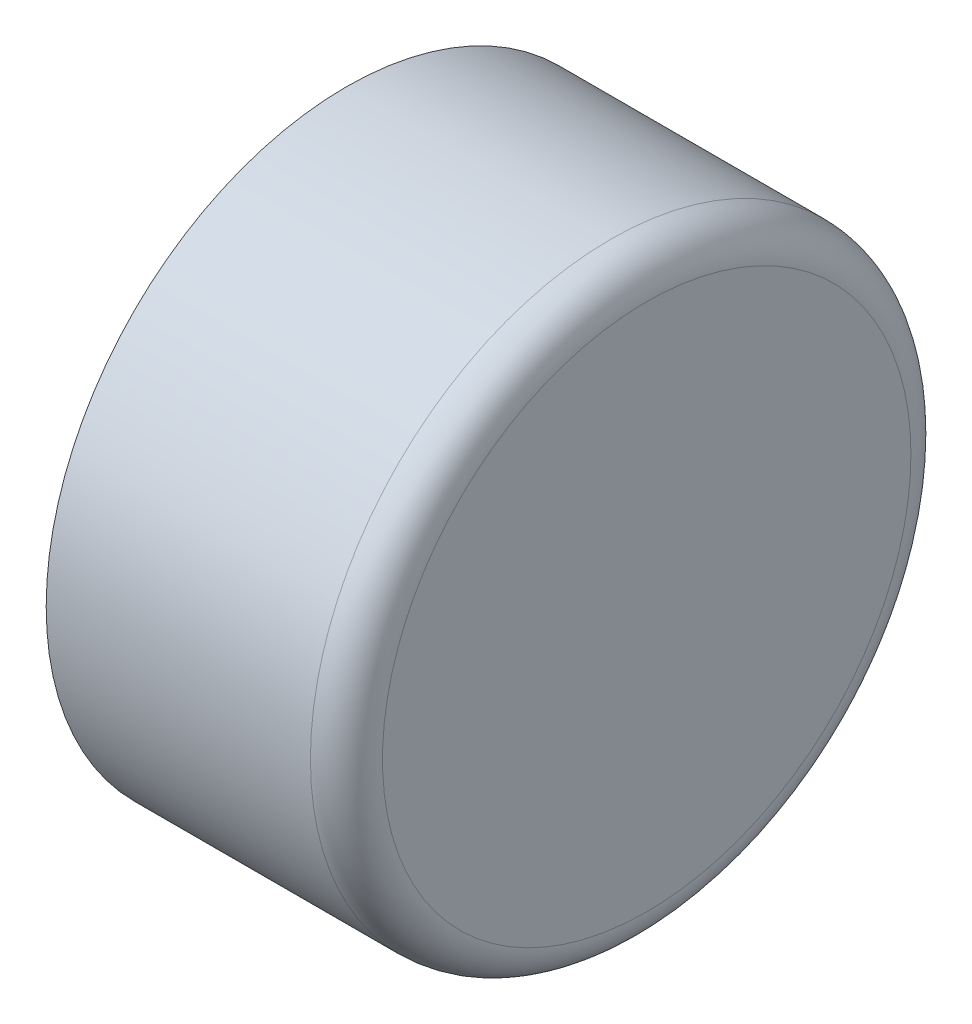
ISO-10303-21;
HEADER;
FILE_DESCRIPTION(('STEP AP214'),'2;1');
FILE_NAME('part.step','',(''),(''),'','','');
FILE_SCHEMA(('AUTOMOTIVE_DESIGN { 1 0 10303 214 1 1 1 1 }'));
ENDSEC;
DATA;
#1=APPLICATION_CONTEXT('core data for automotive mechanical design processes');
#2=APPLICATION_PROTOCOL_DEFINITION('international standard','automotive_design',2000,#1);
#3=PRODUCT_CONTEXT('',#1,'mechanical');
#4=PRODUCT('Part','Part','',(#3));
#5=PRODUCT_RELATED_PRODUCT_CATEGORY('part','',(#4));
#6=PRODUCT_DEFINITION_FORMATION('','',#4);
#7=PRODUCT_DEFINITION_CONTEXT('part definition',#1,'design');
#8=PRODUCT_DEFINITION('design','',#6,#7);
#9=PRODUCT_DEFINITION_SHAPE('','',#8);
#10=(LENGTH_UNIT() NAMED_UNIT(*) SI_UNIT(.MILLI.,.METRE.));
#11=(NAMED_UNIT(*) PLANE_ANGLE_UNIT() SI_UNIT($,.RADIAN.));
#12=(NAMED_UNIT(*) SI_UNIT($,.STERADIAN.) SOLID_ANGLE_UNIT());
#13=UNCERTAINTY_MEASURE_WITH_UNIT(LENGTH_MEASURE(1.E-05),#10,'distance_accuracy_value','');
#14=(GEOMETRIC_REPRESENTATION_CONTEXT(3) GLOBAL_UNCERTAINTY_ASSIGNED_CONTEXT((#13)) GLOBAL_UNIT_ASSIGNED_CONTEXT((#10,
#11,#12)) REPRESENTATION_CONTEXT('',''));
#15=CARTESIAN_POINT('',(0.,0.,0.));
#16=DIRECTION('',(0.,0.,1.));
#17=DIRECTION('',(1.,0.,0.));
#18=AXIS2_PLACEMENT_3D('',#15,#16,#17);
#19=CARTESIAN_POINT('',(3.175,0.,-11.176));
#20=DIRECTION('',(1.,0.,0.));
#21=DIRECTION('',(0.,0.,-1.));
#22=AXIS2_PLACEMENT_3D('',#19,#20,#21);
#23=PLANE('',#22);
#24=CARTESIAN_POINT('',(3.175,0.,0.));
#25=DIRECTION('',(1.,0.,0.));
#26=DIRECTION('',(0.,0.,-1.));
#27=AXIS2_PLACEMENT_3D('',#24,#25,#26);
#28=CIRCLE('',#27,11.176);
#29=CARTESIAN_POINT('',(3.175,0.,-11.176));
#30=VERTEX_POINT('',#29);
#31=EDGE_CURVE('E10',#30,#30,#28,.T.);
#32=ORIENTED_EDGE('',*,*,#31,.T.);
#33=EDGE_LOOP('',(#32));
#34=FACE_BOUND('',#33,.T.);
#35=ADVANCED_FACE('F43',(#34),#23,.T.);
#36=CARTESIAN_POINT('',(1.651,0.,0.));
#37=DIRECTION('',(1.,0.,0.));
#38=DIRECTION('',(0.,0.,-1.));
#39=AXIS2_PLACEMENT_3D('',#36,#37,#38);
#40=TOROIDAL_SURFACE('',#39,11.176,1.524);
#41=CARTESIAN_POINT('',(1.65099999999999,0.,0.));
#42=DIRECTION('',(1.,0.,0.));
#43=DIRECTION('',(0.,0.,-1.));
#44=AXIS2_PLACEMENT_3D('',#41,#42,#43);
#45=CIRCLE('',#44,12.7);
#46=CARTESIAN_POINT('',(1.65099999999999,0.,-12.7));
#47=VERTEX_POINT('',#46);
#48=EDGE_CURVE('E50',#47,#47,#45,.T.);
#49=ORIENTED_EDGE('',*,*,#48,.T.);
#50=EDGE_LOOP('',(#49));
#51=FACE_BOUND('',#50,.T.);
#52=ORIENTED_EDGE('',*,*,#31,.F.);
#53=EDGE_LOOP('',(#52));
#54=FACE_BOUND('',#53,.T.);
#55=ADVANCED_FACE('F95',(#51,#54),#40,.T.);
#56=CARTESIAN_POINT('',(3.175,0.,0.));
#57=DIRECTION('',(1.,0.,0.));
#58=DIRECTION('',(0.,0.,-1.));
#59=AXIS2_PLACEMENT_3D('',#56,#57,#58);
#60=CYLINDRICAL_SURFACE('',#59,12.7);
#61=CARTESIAN_POINT('',(-9.525,0.,0.));
#62=DIRECTION('',(1.,0.,0.));
#63=DIRECTION('',(0.,0.,-1.));
#64=AXIS2_PLACEMENT_3D('',#61,#62,#63);
#65=CIRCLE('',#64,12.7);
#66=CARTESIAN_POINT('',(-9.525,0.,-12.7));
#67=VERTEX_POINT('',#66);
#68=EDGE_CURVE('E55',#67,#67,#65,.T.);
#69=ORIENTED_EDGE('',*,*,#68,.T.);
#70=EDGE_LOOP('',(#69));
#71=FACE_BOUND('',#70,.T.);
#72=ORIENTED_EDGE('',*,*,#48,.F.);
#73=EDGE_LOOP('',(#72));
#74=FACE_BOUND('',#73,.T.);
#75=ADVANCED_FACE('F99',(#71,#74),#60,.T.);
#76=CARTESIAN_POINT('',(-9.525,0.,-11.1125));
#77=DIRECTION('',(-1.,0.,0.));
#78=DIRECTION('',(0.,0.,1.));
#79=AXIS2_PLACEMENT_3D('',#76,#77,#78);
#80=PLANE('',#79);
#81=CARTESIAN_POINT('',(-9.525,0.,0.));
#82=DIRECTION('',(1.,0.,0.));
#83=DIRECTION('',(0.,0.,-1.));
#84=AXIS2_PLACEMENT_3D('',#81,#82,#83);
#85=CIRCLE('',#84,11.1125);
#86=CARTESIAN_POINT('',(-9.525,0.,-11.1125));
#87=VERTEX_POINT('',#86);
#88=EDGE_CURVE('E60',#87,#87,#85,.T.);
#89=ORIENTED_EDGE('',*,*,#88,.T.);
#90=EDGE_LOOP('',(#89));
#91=FACE_BOUND('',#90,.T.);
#92=ORIENTED_EDGE('',*,*,#68,.F.);
#93=EDGE_LOOP('',(#92));
#94=FACE_BOUND('',#93,.T.);
#95=ADVANCED_FACE('F103',(#91,#94),#80,.T.);
#96=CARTESIAN_POINT('',(3.175,0.,0.));
#97=DIRECTION('',(1.,0.,0.));
#98=DIRECTION('',(0.,0.,-1.));
#99=AXIS2_PLACEMENT_3D('',#96,#97,#98);
#100=CYLINDRICAL_SURFACE('',#99,11.1125);
#101=CARTESIAN_POINT('',(-7.9248,0.,0.));
#102=DIRECTION('',(1.,0.,0.));
#103=DIRECTION('',(0.,0.,-1.));
#104=AXIS2_PLACEMENT_3D('',#101,#102,#103);
#105=CIRCLE('',#104,11.1125);
#106=CARTESIAN_POINT('',(-7.9248,0.,-11.1125));
#107=VERTEX_POINT('',#106);
#108=EDGE_CURVE('E66',#107,#107,#105,.T.);
#109=ORIENTED_EDGE('',*,*,#108,.T.);
#110=EDGE_LOOP('',(#109));
#111=FACE_BOUND('',#110,.T.);
#112=ORIENTED_EDGE('',*,*,#88,.F.);
#113=EDGE_LOOP('',(#112));
#114=FACE_BOUND('',#113,.T.);
#115=ADVANCED_FACE('F110',(#111,#114),#100,.F.);
#116=CARTESIAN_POINT('',(-7.9248,0.,-9.525));
#117=DIRECTION('',(-1.,0.,0.));
#118=DIRECTION('',(0.,0.,1.));
#119=AXIS2_PLACEMENT_3D('',#116,#117,#118);
#120=PLANE('',#119);
#121=CARTESIAN_POINT('',(-7.9248,0.,0.));
#122=DIRECTION('',(1.,0.,0.));
#123=DIRECTION('',(0.,0.,-1.));
#124=AXIS2_PLACEMENT_3D('',#121,#122,#123);
#125=CIRCLE('',#124,9.525);
#126=CARTESIAN_POINT('',(-7.9248,0.,-9.525));
#127=VERTEX_POINT('',#126);
#128=EDGE_CURVE('E70',#127,#127,#125,.T.);
#129=ORIENTED_EDGE('',*,*,#128,.T.);
#130=EDGE_LOOP('',(#129));
#131=FACE_BOUND('',#130,.T.);
#132=ORIENTED_EDGE('',*,*,#108,.F.);
#133=EDGE_LOOP('',(#132));
#134=FACE_BOUND('',#133,.T.);
#135=ADVANCED_FACE('F114',(#131,#134),#120,.T.);
#136=CARTESIAN_POINT('',(3.175,0.,0.));
#137=DIRECTION('',(1.,0.,0.));
#138=DIRECTION('',(0.,0.,-1.));
#139=AXIS2_PLACEMENT_3D('',#136,#137,#138);
#140=CYLINDRICAL_SURFACE('',#139,9.525);
#141=CARTESIAN_POINT('',(-1.52400000000001,0.,0.));
#142=DIRECTION('',(1.,0.,0.));
#143=DIRECTION('',(0.,0.,-1.));
#144=AXIS2_PLACEMENT_3D('',#141,#142,#143);
#145=CIRCLE('',#144,9.525);
#146=CARTESIAN_POINT('',(-1.52400000000001,0.,-9.525));
#147=VERTEX_POINT('',#146);
#148=EDGE_CURVE('E74',#147,#147,#145,.T.);
#149=ORIENTED_EDGE('',*,*,#148,.T.);
#150=EDGE_LOOP('',(#149));
#151=FACE_BOUND('',#150,.T.);
#152=ORIENTED_EDGE('',*,*,#128,.F.);
#153=EDGE_LOOP('',(#152));
#154=FACE_BOUND('',#153,.T.);
#155=ADVANCED_FACE('F92',(#151,#154),#140,.F.);
#156=CARTESIAN_POINT('',(-1.524,0.,0.));
#157=DIRECTION('',(1.,0.,0.));
#158=DIRECTION('',(0.,0.,-1.));
#159=AXIS2_PLACEMENT_3D('',#156,#157,#158);
#160=TOROIDAL_SURFACE('',#159,8.001,1.524);
#161=CARTESIAN_POINT('',(0.,0.,0.));
#162=DIRECTION('',(1.,0.,0.));
#163=DIRECTION('',(0.,0.,-1.));
#164=AXIS2_PLACEMENT_3D('',#161,#162,#163);
#165=CIRCLE('',#164,8.00099999999999);
#166=CARTESIAN_POINT('',(0.,0.,-8.00099999999999));
#167=VERTEX_POINT('',#166);
#168=EDGE_CURVE('E78',#167,#167,#165,.T.);
#169=ORIENTED_EDGE('',*,*,#168,.T.);
#170=EDGE_LOOP('',(#169));
#171=FACE_BOUND('',#170,.T.);
#172=ORIENTED_EDGE('',*,*,#148,.F.);
#173=EDGE_LOOP('',(#172));
#174=FACE_BOUND('',#173,.T.);
#175=ADVANCED_FACE('F83',(#171,#174),#160,.F.);
#176=CARTESIAN_POINT('',(0.,0.,0.));
#177=DIRECTION('',(-1.,0.,0.));
#178=DIRECTION('',(0.,0.,1.));
#179=AXIS2_PLACEMENT_3D('',#176,#177,#178);
#180=PLANE('',#179);
#181=ORIENTED_EDGE('',*,*,#168,.F.);
#182=EDGE_LOOP('',(#181));
#183=FACE_BOUND('',#182,.T.);
#184=ADVANCED_FACE('F86',(#183),#180,.T.);
#185=CLOSED_SHELL('',(#35,#55,#75,#95,#115,#135,#155,#175,#184));
#186=MANIFOLD_SOLID_BREP('B2',#185);
#187=ADVANCED_BREP_SHAPE_REPRESENTATION('',(#18,#186),#14);
#188=SHAPE_DEFINITION_REPRESENTATION(#9,#187);
ENDSEC;
END-ISO-10303-21;
